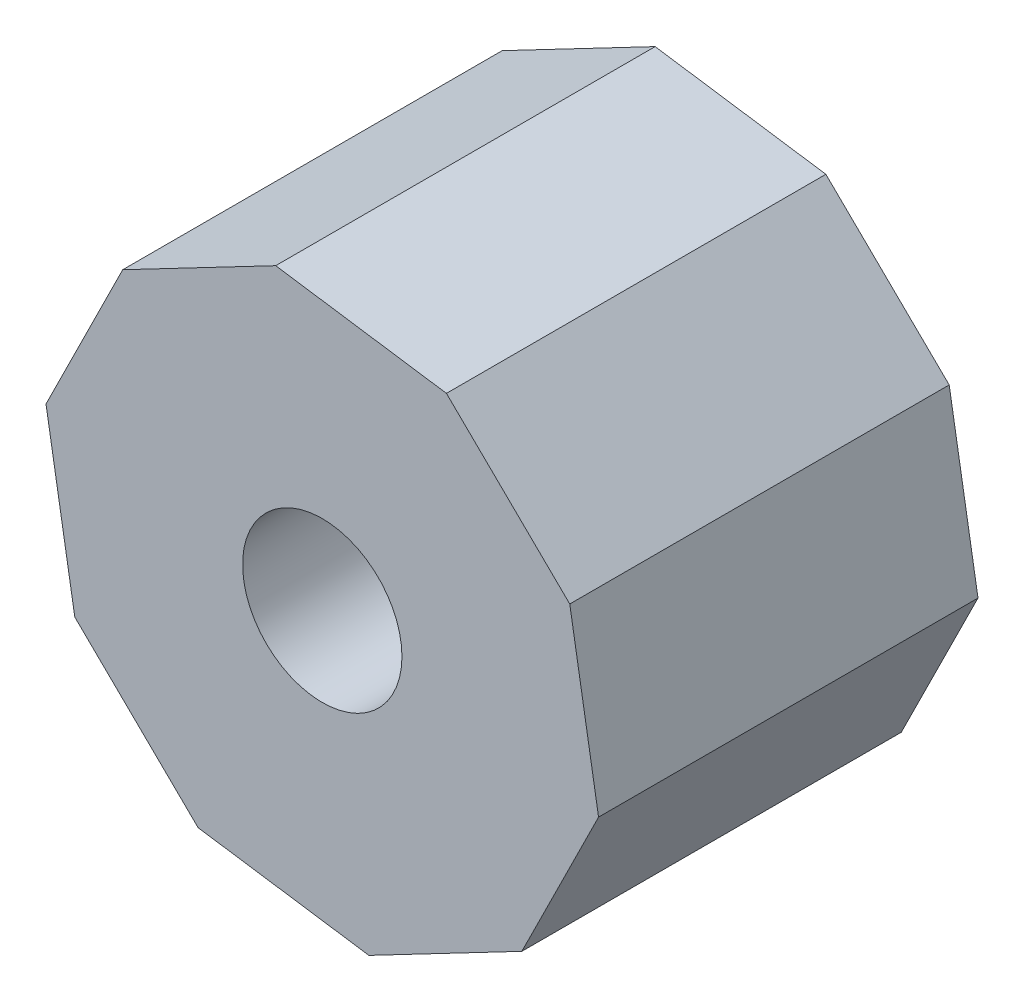
ISO-10303-21;
HEADER;
FILE_DESCRIPTION(('STEP AP214'),'2;1');
FILE_NAME('part.step','',(''),(''),'','','');
FILE_SCHEMA(('AUTOMOTIVE_DESIGN { 1 0 10303 214 1 1 1 1 }'));
ENDSEC;
DATA;
#1=APPLICATION_CONTEXT('core data for automotive mechanical design processes');
#2=APPLICATION_PROTOCOL_DEFINITION('international standard','automotive_design',2000,#1);
#3=PRODUCT_CONTEXT('',#1,'mechanical');
#4=PRODUCT('Part','Part','',(#3));
#5=PRODUCT_RELATED_PRODUCT_CATEGORY('part','',(#4));
#6=PRODUCT_DEFINITION_FORMATION('','',#4);
#7=PRODUCT_DEFINITION_CONTEXT('part definition',#1,'design');
#8=PRODUCT_DEFINITION('design','',#6,#7);
#9=PRODUCT_DEFINITION_SHAPE('','',#8);
#10=(LENGTH_UNIT() NAMED_UNIT(*) SI_UNIT(.MILLI.,.METRE.));
#11=(NAMED_UNIT(*) PLANE_ANGLE_UNIT() SI_UNIT($,.RADIAN.));
#12=(NAMED_UNIT(*) SI_UNIT($,.STERADIAN.) SOLID_ANGLE_UNIT());
#13=UNCERTAINTY_MEASURE_WITH_UNIT(LENGTH_MEASURE(1.E-05),#10,'distance_accuracy_value','');
#14=(GEOMETRIC_REPRESENTATION_CONTEXT(3) GLOBAL_UNCERTAINTY_ASSIGNED_CONTEXT((#13)) GLOBAL_UNIT_ASSIGNED_CONTEXT((#10,
#11,#12)) REPRESENTATION_CONTEXT('',''));
#15=CARTESIAN_POINT('',(0.,0.,0.));
#16=DIRECTION('',(0.,0.,1.));
#17=DIRECTION('',(1.,0.,0.));
#18=AXIS2_PLACEMENT_3D('',#15,#16,#17);
#19=CARTESIAN_POINT('',(-2.54590904960447,-3.21273721995364,10.));
#20=DIRECTION('',(0.14599317271029,0.989285597551073,0.));
#21=DIRECTION('',(-0.989285597551073,0.14599317271029,0.));
#22=AXIS2_PLACEMENT_3D('',#19,#20,#21);
#23=PLANE('',#22);
#24=DIRECTION('',(0.,0.,-1.));
#25=VECTOR('',#24,1.);
#26=CARTESIAN_POINT('',(-2.54590904960447,-3.21273721995364,10.));
#27=LINE('',#26,#25);
#28=CARTESIAN_POINT('',(-2.54590904960447,-3.21273721995364,6.));
#29=VERTEX_POINT('',#28);
#30=CARTESIAN_POINT('',(-2.54590904960447,-3.21273721995364,0.));
#31=VERTEX_POINT('',#30);
#32=EDGE_CURVE('E58',#29,#31,#27,.T.);
#33=ORIENTED_EDGE('',*,*,#32,.F.);
#34=DIRECTION('',(0.989285597551073,-0.14599317271029,0.));
#35=VECTOR('',#34,1.);
#36=CARTESIAN_POINT('',(-2.54590904960447,-3.21273721995364,6.));
#37=LINE('',#36,#35);
#38=CARTESIAN_POINT('',(1.50935752336141,-3.81119052265898,6.));
#39=VERTEX_POINT('',#38);
#40=EDGE_CURVE('E52',#29,#39,#37,.T.);
#41=ORIENTED_EDGE('',*,*,#40,.T.);
#42=DIRECTION('',(0.,0.,-1.));
#43=VECTOR('',#42,1.);
#44=CARTESIAN_POINT('',(1.50935752336141,-3.81119052265898,10.));
#45=LINE('',#44,#43);
#46=CARTESIAN_POINT('',(1.50935752336141,-3.81119052265898,0.));
#47=VERTEX_POINT('',#46);
#48=EDGE_CURVE('E175',#39,#47,#45,.T.);
#49=ORIENTED_EDGE('',*,*,#48,.T.);
#50=DIRECTION('',(0.989285597551073,-0.14599317271029,0.));
#51=VECTOR('',#50,1.);
#52=CARTESIAN_POINT('',(-2.54590904960447,-3.21273721995364,0.));
#53=LINE('',#52,#51);
#54=EDGE_CURVE('E487',#31,#47,#53,.T.);
#55=ORIENTED_EDGE('',*,*,#54,.F.);
#56=EDGE_LOOP('',(#33,#41,#49,#55));
#57=FACE_BOUND('',#56,.T.);
#58=ADVANCED_FACE('F37',(#57),#23,.T.);
#59=CARTESIAN_POINT('',(1.50935752336141,-3.81119052265898,10.));
#60=DIRECTION('',(-0.783749872722152,0.621076595121737,0.));
#61=DIRECTION('',(-0.621076595121737,-0.783749872722153,0.));
#62=AXIS2_PLACEMENT_3D('',#59,#60,#61);
#63=PLANE('',#62);
#64=ORIENTED_EDGE('',*,*,#48,.F.);
#65=DIRECTION('',(0.621076595121737,0.783749872722153,0.));
#66=VECTOR('',#65,1.);
#67=CARTESIAN_POINT('',(1.50935752336141,-3.81119052265898,6.));
#68=LINE('',#67,#66);
#69=CARTESIAN_POINT('',(4.05526657296588,-0.598453302705346,6.));
#70=VERTEX_POINT('',#69);
#71=EDGE_CURVE('E481',#39,#70,#68,.T.);
#72=ORIENTED_EDGE('',*,*,#71,.T.);
#73=DIRECTION('',(0.,0.,-1.));
#74=VECTOR('',#73,1.);
#75=CARTESIAN_POINT('',(4.05526657296588,-0.598453302705346,10.));
#76=LINE('',#75,#74);
#77=CARTESIAN_POINT('',(4.05526657296588,-0.598453302705346,0.));
#78=VERTEX_POINT('',#77);
#79=EDGE_CURVE('E173',#70,#78,#76,.T.);
#80=ORIENTED_EDGE('',*,*,#79,.T.);
#81=DIRECTION('',(0.621076595121737,0.783749872722152,0.));
#82=VECTOR('',#81,1.);
#83=CARTESIAN_POINT('',(1.50935752336141,-3.81119052265898,0.));
#84=LINE('',#83,#82);
#85=EDGE_CURVE('E490',#47,#78,#84,.T.);
#86=ORIENTED_EDGE('',*,*,#85,.F.);
#87=EDGE_LOOP('',(#64,#72,#80,#86));
#88=FACE_BOUND('',#87,.T.);
#89=ADVANCED_FACE('F308',(#88),#63,.T.);
#90=CARTESIAN_POINT('',(4.05526657296588,-0.598453302705346,10.));
#91=DIRECTION('',(-0.929743045432443,-0.368209002429336,0.));
#92=DIRECTION('',(0.368209002429336,-0.929743045432443,0.));
#93=AXIS2_PLACEMENT_3D('',#90,#91,#92);
#94=PLANE('',#93);
#95=ORIENTED_EDGE('',*,*,#79,.F.);
#96=DIRECTION('',(-0.368209002429336,0.929743045432443,0.));
#97=VECTOR('',#96,1.);
#98=CARTESIAN_POINT('',(4.05526657296588,-0.598453302705346,6.));
#99=LINE('',#98,#97);
#100=CARTESIAN_POINT('',(2.54590904960447,3.21273721995364,6.));
#101=VERTEX_POINT('',#100);
#102=EDGE_CURVE('E479',#70,#101,#99,.T.);
#103=ORIENTED_EDGE('',*,*,#102,.T.);
#104=DIRECTION('',(0.,0.,-1.));
#105=VECTOR('',#104,1.);
#106=CARTESIAN_POINT('',(2.54590904960447,3.21273721995364,10.));
#107=LINE('',#106,#105);
#108=CARTESIAN_POINT('',(2.54590904960447,3.21273721995364,0.));
#109=VERTEX_POINT('',#108);
#110=EDGE_CURVE('E167',#101,#109,#107,.T.);
#111=ORIENTED_EDGE('',*,*,#110,.T.);
#112=DIRECTION('',(-0.368209002429336,0.929743045432443,0.));
#113=VECTOR('',#112,1.);
#114=CARTESIAN_POINT('',(4.05526657296588,-0.598453302705346,0.));
#115=LINE('',#114,#113);
#116=EDGE_CURVE('E477',#78,#109,#115,.T.);
#117=ORIENTED_EDGE('',*,*,#116,.F.);
#118=EDGE_LOOP('',(#95,#103,#111,#117));
#119=FACE_BOUND('',#118,.T.);
#120=ADVANCED_FACE('F314',(#119),#94,.T.);
#121=CARTESIAN_POINT('',(2.54590904960447,3.21273721995364,10.));
#122=DIRECTION('',(-0.14599317271029,-0.989285597551073,0.));
#123=DIRECTION('',(0.989285597551073,-0.14599317271029,0.));
#124=AXIS2_PLACEMENT_3D('',#121,#122,#123);
#125=PLANE('',#124);
#126=ORIENTED_EDGE('',*,*,#110,.F.);
#127=DIRECTION('',(-0.989285597551073,0.14599317271029,0.));
#128=VECTOR('',#127,1.);
#129=CARTESIAN_POINT('',(2.54590904960447,3.21273721995364,6.));
#130=LINE('',#129,#128);
#131=CARTESIAN_POINT('',(-1.50935752336141,3.81119052265899,6.));
#132=VERTEX_POINT('',#131);
#133=EDGE_CURVE('E159',#101,#132,#130,.T.);
#134=ORIENTED_EDGE('',*,*,#133,.T.);
#135=DIRECTION('',(0.,0.,-1.));
#136=VECTOR('',#135,1.);
#137=CARTESIAN_POINT('',(-1.50935752336141,3.81119052265899,10.));
#138=LINE('',#137,#136);
#139=CARTESIAN_POINT('',(-1.50935752336141,3.81119052265899,0.));
#140=VERTEX_POINT('',#139);
#141=EDGE_CURVE('E158',#132,#140,#138,.T.);
#142=ORIENTED_EDGE('',*,*,#141,.T.);
#143=DIRECTION('',(-0.989285597551073,0.14599317271029,0.));
#144=VECTOR('',#143,1.);
#145=CARTESIAN_POINT('',(2.54590904960447,3.21273721995364,0.));
#146=LINE('',#145,#144);
#147=EDGE_CURVE('E472',#109,#140,#146,.T.);
#148=ORIENTED_EDGE('',*,*,#147,.F.);
#149=EDGE_LOOP('',(#126,#134,#142,#148));
#150=FACE_BOUND('',#149,.T.);
#151=ADVANCED_FACE('F391',(#150),#125,.T.);
#152=CARTESIAN_POINT('',(-1.50935752336141,3.81119052265899,10.));
#153=DIRECTION('',(0.783749872722153,-0.621076595121737,0.));
#154=DIRECTION('',(0.621076595121737,0.783749872722153,0.));
#155=AXIS2_PLACEMENT_3D('',#152,#153,#154);
#156=PLANE('',#155);
#157=ORIENTED_EDGE('',*,*,#141,.F.);
#158=DIRECTION('',(-0.621076595121737,-0.783749872722153,0.));
#159=VECTOR('',#158,1.);
#160=CARTESIAN_POINT('',(-1.50935752336141,3.81119052265899,6.));
#161=LINE('',#160,#159);
#162=CARTESIAN_POINT('',(-4.05526657296588,0.598453302705348,6.));
#163=VERTEX_POINT('',#162);
#164=EDGE_CURVE('E150',#132,#163,#161,.T.);
#165=ORIENTED_EDGE('',*,*,#164,.T.);
#166=DIRECTION('',(0.,0.,-1.));
#167=VECTOR('',#166,1.);
#168=CARTESIAN_POINT('',(-4.05526657296588,0.598453302705348,10.));
#169=LINE('',#168,#167);
#170=CARTESIAN_POINT('',(-4.05526657296588,0.598453302705348,0.));
#171=VERTEX_POINT('',#170);
#172=EDGE_CURVE('E157',#163,#171,#169,.T.);
#173=ORIENTED_EDGE('',*,*,#172,.T.);
#174=DIRECTION('',(-0.621076595121737,-0.783749872722153,0.));
#175=VECTOR('',#174,1.);
#176=CARTESIAN_POINT('',(-1.50935752336141,3.81119052265899,0.));
#177=LINE('',#176,#175);
#178=EDGE_CURVE('E494',#140,#171,#177,.T.);
#179=ORIENTED_EDGE('',*,*,#178,.F.);
#180=EDGE_LOOP('',(#157,#165,#173,#179));
#181=FACE_BOUND('',#180,.T.);
#182=ADVANCED_FACE('F155',(#181),#156,.T.);
#183=CARTESIAN_POINT('',(-4.05526657296588,0.598453302705348,10.));
#184=DIRECTION('',(0.929743045432443,0.368209002429336,0.));
#185=DIRECTION('',(-0.368209002429336,0.929743045432443,0.));
#186=AXIS2_PLACEMENT_3D('',#183,#184,#185);
#187=PLANE('',#186);
#188=ORIENTED_EDGE('',*,*,#172,.F.);
#189=DIRECTION('',(0.368209002429336,-0.929743045432443,0.));
#190=VECTOR('',#189,1.);
#191=CARTESIAN_POINT('',(-4.05526657296588,0.598453302705348,6.));
#192=LINE('',#191,#190);
#193=EDGE_CURVE('E11',#163,#29,#192,.T.);
#194=ORIENTED_EDGE('',*,*,#193,.T.);
#195=ORIENTED_EDGE('',*,*,#32,.T.);
#196=DIRECTION('',(0.368209002429336,-0.929743045432443,0.));
#197=VECTOR('',#196,1.);
#198=CARTESIAN_POINT('',(-4.05526657296588,0.598453302705348,0.));
#199=LINE('',#198,#197);
#200=EDGE_CURVE('E164',#171,#31,#199,.T.);
#201=ORIENTED_EDGE('',*,*,#200,.F.);
#202=EDGE_LOOP('',(#188,#194,#195,#201));
#203=FACE_BOUND('',#202,.T.);
#204=ADVANCED_FACE('F162',(#203),#187,.T.);
#205=CARTESIAN_POINT('',(0.,0.,10.));
#206=DIRECTION('',(0.,0.,1.));
#207=DIRECTION('',(1.,0.,0.));
#208=AXIS2_PLACEMENT_3D('',#205,#206,#207);
#209=PLANE('',#208);
#210=DIRECTION('',(0.166858303692931,-0.985980885458089,0.));
#211=VECTOR('',#210,1.);
#212=CARTESIAN_POINT('',(-7.28137504365553,1.07454414271095,10.));
#213=LINE('',#212,#211);
#214=CARTESIAN_POINT('',(-7.28137504365553,1.07454414271095,10.));
#215=VERTEX_POINT('',#214);
#216=CARTESIAN_POINT('',(-6.52235735275769,-3.41056039441198,10.));
#217=VERTEX_POINT('',#216);
#218=EDGE_CURVE('E178',#215,#217,#213,.T.);
#219=ORIENTED_EDGE('',*,*,#218,.T.);
#220=DIRECTION('',(0.714536226854697,-0.699598442331209,0.));
#221=VECTOR('',#220,1.);
#222=CARTESIAN_POINT('',(-6.52235735275769,-3.41056039441198,10.));
#223=LINE('',#222,#221);
#224=CARTESIAN_POINT('',(-3.2720208398792,-6.59294678155377,10.));
#225=VERTEX_POINT('',#224);
#226=EDGE_CURVE('E181',#217,#225,#223,.T.);
#227=ORIENTED_EDGE('',*,*,#226,.T.);
#228=DIRECTION('',(0.989285597551073,-0.14599317271029,0.));
#229=VECTOR('',#228,1.);
#230=CARTESIAN_POINT('',(-3.2720208398792,-6.59294678155377,10.));
#231=LINE('',#230,#229);
#232=CARTESIAN_POINT('',(1.22811642193517,-7.25705158416125,10.));
#233=VERTEX_POINT('',#232);
#234=EDGE_CURVE('E184',#225,#233,#231,.T.);
#235=ORIENTED_EDGE('',*,*,#234,.T.);
#236=DIRECTION('',(0.886161494563689,0.463376526760526,0.));
#237=VECTOR('',#236,1.);
#238=CARTESIAN_POINT('',(1.22811642193517,-7.25705158416125,10.));
#239=LINE('',#238,#237);
#240=CARTESIAN_POINT('',(5.25915495271223,-5.14920933973039,10.));
#241=VERTEX_POINT('',#240);
#242=EDGE_CURVE('E186',#233,#241,#239,.T.);
#243=ORIENTED_EDGE('',*,*,#242,.T.);
#244=DIRECTION('',(0.444553820174381,0.895752142597697,0.));
#245=VECTOR('',#244,1.);
#246=CARTESIAN_POINT('',(5.25915495271223,-5.14920933973039,10.));
#247=LINE('',#246,#245);
#248=CARTESIAN_POINT('',(7.28137504365556,-1.07454414271093,10.));
#249=VERTEX_POINT('',#248);
#250=EDGE_CURVE('E188',#241,#249,#247,.T.);
#251=ORIENTED_EDGE('',*,*,#250,.T.);
#252=DIRECTION('',(-0.166858303692931,0.985980885458089,0.));
#253=VECTOR('',#252,1.);
#254=CARTESIAN_POINT('',(7.28137504365556,-1.07454414271093,10.));
#255=LINE('',#254,#253);
#256=CARTESIAN_POINT('',(6.52235735275772,3.41056039441199,10.));
#257=VERTEX_POINT('',#256);
#258=EDGE_CURVE('E190',#249,#257,#255,.T.);
#259=ORIENTED_EDGE('',*,*,#258,.T.);
#260=DIRECTION('',(-0.714536226854697,0.699598442331208,0.));
#261=VECTOR('',#260,1.);
#262=CARTESIAN_POINT('',(6.52235735275772,3.41056039441199,10.));
#263=LINE('',#262,#261);
#264=CARTESIAN_POINT('',(3.27202083987923,6.59294678155378,10.));
#265=VERTEX_POINT('',#264);
#266=EDGE_CURVE('E192',#257,#265,#263,.T.);
#267=ORIENTED_EDGE('',*,*,#266,.T.);
#268=DIRECTION('',(-0.989285597551073,0.14599317271029,0.));
#269=VECTOR('',#268,1.);
#270=CARTESIAN_POINT('',(3.27202083987923,6.59294678155378,10.));
#271=LINE('',#270,#269);
#272=CARTESIAN_POINT('',(-1.22811642193514,7.25705158416126,10.));
#273=VERTEX_POINT('',#272);
#274=EDGE_CURVE('E194',#265,#273,#271,.T.);
#275=ORIENTED_EDGE('',*,*,#274,.T.);
#276=DIRECTION('',(-0.886161494563689,-0.463376526760526,0.));
#277=VECTOR('',#276,1.);
#278=CARTESIAN_POINT('',(-1.22811642193514,7.25705158416126,10.));
#279=LINE('',#278,#277);
#280=CARTESIAN_POINT('',(-5.25915495271219,5.14920933973041,10.));
#281=VERTEX_POINT('',#280);
#282=EDGE_CURVE('E196',#273,#281,#279,.T.);
#283=ORIENTED_EDGE('',*,*,#282,.T.);
#284=DIRECTION('',(-0.444553820174381,-0.895752142597697,0.));
#285=VECTOR('',#284,1.);
#286=CARTESIAN_POINT('',(-5.25915495271219,5.14920933973041,10.));
#287=LINE('',#286,#285);
#288=EDGE_CURVE('E198',#281,#215,#287,.T.);
#289=ORIENTED_EDGE('',*,*,#288,.T.);
#290=EDGE_LOOP('',(#219,#227,#235,#243,#251,#259,#267,#275,#283,#289));
#291=FACE_BOUND('',#290,.T.);
#292=CARTESIAN_POINT('',(0.,0.,10.));
#293=DIRECTION('',(0.,0.,1.));
#294=DIRECTION('',(1.,0.,0.));
#295=AXIS2_PLACEMENT_3D('',#292,#293,#294);
#296=CIRCLE('',#295,2.1);
#297=CARTESIAN_POINT('',(2.1,0.,10.));
#298=VERTEX_POINT('',#297);
#299=EDGE_CURVE('E498',#298,#298,#296,.T.);
#300=ORIENTED_EDGE('',*,*,#299,.F.);
#301=EDGE_LOOP('',(#300));
#302=FACE_BOUND('',#301,.T.);
#303=ADVANCED_FACE('F272',(#291,#302),#209,.T.);
#304=CARTESIAN_POINT('',(0.,0.,0.));
#305=DIRECTION('',(0.,0.,1.));
#306=DIRECTION('',(1.,0.,0.));
#307=AXIS2_PLACEMENT_3D('',#304,#305,#306);
#308=PLANE('',#307);
#309=DIRECTION('',(0.166858303692931,-0.985980885458089,0.));
#310=VECTOR('',#309,1.);
#311=CARTESIAN_POINT('',(-7.28137504365553,1.07454414271095,0.));
#312=LINE('',#311,#310);
#313=CARTESIAN_POINT('',(-7.28137504365553,1.07454414271095,0.));
#314=VERTEX_POINT('',#313);
#315=CARTESIAN_POINT('',(-6.52235735275769,-3.41056039441198,0.));
#316=VERTEX_POINT('',#315);
#317=EDGE_CURVE('E177',#314,#316,#312,.T.);
#318=ORIENTED_EDGE('',*,*,#317,.F.);
#319=DIRECTION('',(-0.444553820174381,-0.895752142597697,0.));
#320=VECTOR('',#319,1.);
#321=CARTESIAN_POINT('',(-5.25915495271219,5.14920933973041,0.));
#322=LINE('',#321,#320);
#323=CARTESIAN_POINT('',(-5.25915495271219,5.14920933973041,0.));
#324=VERTEX_POINT('',#323);
#325=EDGE_CURVE('E182',#324,#314,#322,.T.);
#326=ORIENTED_EDGE('',*,*,#325,.F.);
#327=DIRECTION('',(-0.886161494563689,-0.463376526760526,0.));
#328=VECTOR('',#327,1.);
#329=CARTESIAN_POINT('',(-1.22811642193514,7.25705158416126,0.));
#330=LINE('',#329,#328);
#331=CARTESIAN_POINT('',(-1.22811642193514,7.25705158416126,0.));
#332=VERTEX_POINT('',#331);
#333=EDGE_CURVE('E217',#332,#324,#330,.T.);
#334=ORIENTED_EDGE('',*,*,#333,.F.);
#335=DIRECTION('',(-0.989285597551073,0.14599317271029,0.));
#336=VECTOR('',#335,1.);
#337=CARTESIAN_POINT('',(3.27202083987923,6.59294678155378,0.));
#338=LINE('',#337,#336);
#339=CARTESIAN_POINT('',(3.27202083987923,6.59294678155378,0.));
#340=VERTEX_POINT('',#339);
#341=EDGE_CURVE('E215',#340,#332,#338,.T.);
#342=ORIENTED_EDGE('',*,*,#341,.F.);
#343=DIRECTION('',(-0.714536226854697,0.699598442331208,0.));
#344=VECTOR('',#343,1.);
#345=CARTESIAN_POINT('',(6.52235735275772,3.41056039441199,0.));
#346=LINE('',#345,#344);
#347=CARTESIAN_POINT('',(6.52235735275772,3.41056039441199,0.));
#348=VERTEX_POINT('',#347);
#349=EDGE_CURVE('E213',#348,#340,#346,.T.);
#350=ORIENTED_EDGE('',*,*,#349,.F.);
#351=DIRECTION('',(-0.166858303692931,0.985980885458089,0.));
#352=VECTOR('',#351,1.);
#353=CARTESIAN_POINT('',(7.28137504365556,-1.07454414271093,0.));
#354=LINE('',#353,#352);
#355=CARTESIAN_POINT('',(7.28137504365556,-1.07454414271093,0.));
#356=VERTEX_POINT('',#355);
#357=EDGE_CURVE('E211',#356,#348,#354,.T.);
#358=ORIENTED_EDGE('',*,*,#357,.F.);
#359=DIRECTION('',(0.444553820174381,0.895752142597697,0.));
#360=VECTOR('',#359,1.);
#361=CARTESIAN_POINT('',(5.25915495271223,-5.14920933973039,0.));
#362=LINE('',#361,#360);
#363=CARTESIAN_POINT('',(5.25915495271223,-5.14920933973039,0.));
#364=VERTEX_POINT('',#363);
#365=EDGE_CURVE('E209',#364,#356,#362,.T.);
#366=ORIENTED_EDGE('',*,*,#365,.F.);
#367=DIRECTION('',(0.886161494563689,0.463376526760526,0.));
#368=VECTOR('',#367,1.);
#369=CARTESIAN_POINT('',(1.22811642193517,-7.25705158416125,0.));
#370=LINE('',#369,#368);
#371=CARTESIAN_POINT('',(1.22811642193517,-7.25705158416125,0.));
#372=VERTEX_POINT('',#371);
#373=EDGE_CURVE('E207',#372,#364,#370,.T.);
#374=ORIENTED_EDGE('',*,*,#373,.F.);
#375=DIRECTION('',(0.989285597551073,-0.14599317271029,0.));
#376=VECTOR('',#375,1.);
#377=CARTESIAN_POINT('',(-3.2720208398792,-6.59294678155377,0.));
#378=LINE('',#377,#376);
#379=CARTESIAN_POINT('',(-3.2720208398792,-6.59294678155377,0.));
#380=VERTEX_POINT('',#379);
#381=EDGE_CURVE('E205',#380,#372,#378,.T.);
#382=ORIENTED_EDGE('',*,*,#381,.F.);
#383=DIRECTION('',(0.714536226854697,-0.699598442331209,0.));
#384=VECTOR('',#383,1.);
#385=CARTESIAN_POINT('',(-6.52235735275769,-3.41056039441198,0.));
#386=LINE('',#385,#384);
#387=EDGE_CURVE('E203',#316,#380,#386,.T.);
#388=ORIENTED_EDGE('',*,*,#387,.F.);
#389=EDGE_LOOP('',(#318,#326,#334,#342,#350,#358,#366,#374,#382,#388));
#390=FACE_BOUND('',#389,.T.);
#391=ORIENTED_EDGE('',*,*,#54,.T.);
#392=ORIENTED_EDGE('',*,*,#85,.T.);
#393=ORIENTED_EDGE('',*,*,#116,.T.);
#394=ORIENTED_EDGE('',*,*,#147,.T.);
#395=ORIENTED_EDGE('',*,*,#178,.T.);
#396=ORIENTED_EDGE('',*,*,#200,.T.);
#397=EDGE_LOOP('',(#391,#392,#393,#394,#395,#396));
#398=FACE_BOUND('',#397,.T.);
#399=ADVANCED_FACE('F256',(#390,#398),#308,.F.);
#400=CARTESIAN_POINT('',(-7.28137504365553,1.07454414271095,10.));
#401=DIRECTION('',(0.985980885458089,0.166858303692931,0.));
#402=DIRECTION('',(-0.166858303692931,0.985980885458089,0.));
#403=AXIS2_PLACEMENT_3D('',#400,#401,#402);
#404=PLANE('',#403);
#405=ORIENTED_EDGE('',*,*,#317,.T.);
#406=DIRECTION('',(0.,0.,-1.));
#407=VECTOR('',#406,1.);
#408=CARTESIAN_POINT('',(-6.52235735275769,-3.41056039441198,10.));
#409=LINE('',#408,#407);
#410=EDGE_CURVE('E45',#217,#316,#409,.T.);
#411=ORIENTED_EDGE('',*,*,#410,.F.);
#412=ORIENTED_EDGE('',*,*,#218,.F.);
#413=DIRECTION('',(0.,0.,-1.));
#414=VECTOR('',#413,1.);
#415=CARTESIAN_POINT('',(-7.28137504365553,1.07454414271095,10.));
#416=LINE('',#415,#414);
#417=EDGE_CURVE('E200',#215,#314,#416,.T.);
#418=ORIENTED_EDGE('',*,*,#417,.T.);
#419=EDGE_LOOP('',(#405,#411,#412,#418));
#420=FACE_BOUND('',#419,.T.);
#421=ADVANCED_FACE('F39',(#420),#404,.F.);
#422=CARTESIAN_POINT('',(-6.52235735275769,-3.41056039441198,10.));
#423=DIRECTION('',(0.699598442331209,0.714536226854697,0.));
#424=DIRECTION('',(-0.714536226854697,0.699598442331209,0.));
#425=AXIS2_PLACEMENT_3D('',#422,#423,#424);
#426=PLANE('',#425);
#427=ORIENTED_EDGE('',*,*,#387,.T.);
#428=DIRECTION('',(0.,0.,-1.));
#429=VECTOR('',#428,1.);
#430=CARTESIAN_POINT('',(-3.2720208398792,-6.59294678155377,10.));
#431=LINE('',#430,#429);
#432=EDGE_CURVE('E243',#225,#380,#431,.T.);
#433=ORIENTED_EDGE('',*,*,#432,.F.);
#434=ORIENTED_EDGE('',*,*,#226,.F.);
#435=ORIENTED_EDGE('',*,*,#410,.T.);
#436=EDGE_LOOP('',(#427,#433,#434,#435));
#437=FACE_BOUND('',#436,.T.);
#438=ADVANCED_FACE('F248',(#437),#426,.F.);
#439=CARTESIAN_POINT('',(-3.2720208398792,-6.59294678155377,10.));
#440=DIRECTION('',(0.14599317271029,0.989285597551073,0.));
#441=DIRECTION('',(-0.989285597551073,0.14599317271029,0.));
#442=AXIS2_PLACEMENT_3D('',#439,#440,#441);
#443=PLANE('',#442);
#444=ORIENTED_EDGE('',*,*,#381,.T.);
#445=DIRECTION('',(0.,0.,-1.));
#446=VECTOR('',#445,1.);
#447=CARTESIAN_POINT('',(1.22811642193517,-7.25705158416125,10.));
#448=LINE('',#447,#446);
#449=EDGE_CURVE('E240',#233,#372,#448,.T.);
#450=ORIENTED_EDGE('',*,*,#449,.F.);
#451=ORIENTED_EDGE('',*,*,#234,.F.);
#452=ORIENTED_EDGE('',*,*,#432,.T.);
#453=EDGE_LOOP('',(#444,#450,#451,#452));
#454=FACE_BOUND('',#453,.T.);
#455=ADVANCED_FACE('F264',(#454),#443,.F.);
#456=CARTESIAN_POINT('',(1.22811642193517,-7.25705158416125,10.));
#457=DIRECTION('',(-0.463376526760526,0.886161494563689,0.));
#458=DIRECTION('',(-0.886161494563689,-0.463376526760526,0.));
#459=AXIS2_PLACEMENT_3D('',#456,#457,#458);
#460=PLANE('',#459);
#461=ORIENTED_EDGE('',*,*,#373,.T.);
#462=DIRECTION('',(0.,0.,-1.));
#463=VECTOR('',#462,1.);
#464=CARTESIAN_POINT('',(5.25915495271223,-5.14920933973039,10.));
#465=LINE('',#464,#463);
#466=EDGE_CURVE('E237',#241,#364,#465,.T.);
#467=ORIENTED_EDGE('',*,*,#466,.F.);
#468=ORIENTED_EDGE('',*,*,#242,.F.);
#469=ORIENTED_EDGE('',*,*,#449,.T.);
#470=EDGE_LOOP('',(#461,#467,#468,#469));
#471=FACE_BOUND('',#470,.T.);
#472=ADVANCED_FACE('F268',(#471),#460,.F.);
#473=CARTESIAN_POINT('',(5.25915495271223,-5.14920933973039,10.));
#474=DIRECTION('',(-0.895752142597697,0.444553820174381,0.));
#475=DIRECTION('',(-0.444553820174381,-0.895752142597697,0.));
#476=AXIS2_PLACEMENT_3D('',#473,#474,#475);
#477=PLANE('',#476);
#478=ORIENTED_EDGE('',*,*,#365,.T.);
#479=DIRECTION('',(0.,0.,-1.));
#480=VECTOR('',#479,1.);
#481=CARTESIAN_POINT('',(7.28137504365556,-1.07454414271093,10.));
#482=LINE('',#481,#480);
#483=EDGE_CURVE('E234',#249,#356,#482,.T.);
#484=ORIENTED_EDGE('',*,*,#483,.F.);
#485=ORIENTED_EDGE('',*,*,#250,.F.);
#486=ORIENTED_EDGE('',*,*,#466,.T.);
#487=EDGE_LOOP('',(#478,#484,#485,#486));
#488=FACE_BOUND('',#487,.T.);
#489=ADVANCED_FACE('F298',(#488),#477,.F.);
#490=CARTESIAN_POINT('',(7.28137504365556,-1.07454414271093,10.));
#491=DIRECTION('',(-0.985980885458089,-0.166858303692931,0.));
#492=DIRECTION('',(0.166858303692931,-0.985980885458089,0.));
#493=AXIS2_PLACEMENT_3D('',#490,#491,#492);
#494=PLANE('',#493);
#495=ORIENTED_EDGE('',*,*,#357,.T.);
#496=DIRECTION('',(0.,0.,-1.));
#497=VECTOR('',#496,1.);
#498=CARTESIAN_POINT('',(6.52235735275772,3.41056039441199,10.));
#499=LINE('',#498,#497);
#500=EDGE_CURVE('E231',#257,#348,#499,.T.);
#501=ORIENTED_EDGE('',*,*,#500,.F.);
#502=ORIENTED_EDGE('',*,*,#258,.F.);
#503=ORIENTED_EDGE('',*,*,#483,.T.);
#504=EDGE_LOOP('',(#495,#501,#502,#503));
#505=FACE_BOUND('',#504,.T.);
#506=ADVANCED_FACE('F296',(#505),#494,.F.);
#507=CARTESIAN_POINT('',(6.52235735275772,3.41056039441199,10.));
#508=DIRECTION('',(-0.699598442331208,-0.714536226854697,0.));
#509=DIRECTION('',(0.714536226854697,-0.699598442331209,0.));
#510=AXIS2_PLACEMENT_3D('',#507,#508,#509);
#511=PLANE('',#510);
#512=ORIENTED_EDGE('',*,*,#349,.T.);
#513=DIRECTION('',(0.,0.,-1.));
#514=VECTOR('',#513,1.);
#515=CARTESIAN_POINT('',(3.27202083987923,6.59294678155378,10.));
#516=LINE('',#515,#514);
#517=EDGE_CURVE('E228',#265,#340,#516,.T.);
#518=ORIENTED_EDGE('',*,*,#517,.F.);
#519=ORIENTED_EDGE('',*,*,#266,.F.);
#520=ORIENTED_EDGE('',*,*,#500,.T.);
#521=EDGE_LOOP('',(#512,#518,#519,#520));
#522=FACE_BOUND('',#521,.T.);
#523=ADVANCED_FACE('F292',(#522),#511,.F.);
#524=CARTESIAN_POINT('',(3.27202083987923,6.59294678155378,10.));
#525=DIRECTION('',(-0.14599317271029,-0.989285597551073,0.));
#526=DIRECTION('',(0.989285597551073,-0.14599317271029,0.));
#527=AXIS2_PLACEMENT_3D('',#524,#525,#526);
#528=PLANE('',#527);
#529=ORIENTED_EDGE('',*,*,#341,.T.);
#530=DIRECTION('',(0.,0.,-1.));
#531=VECTOR('',#530,1.);
#532=CARTESIAN_POINT('',(-1.22811642193514,7.25705158416126,10.));
#533=LINE('',#532,#531);
#534=EDGE_CURVE('E225',#273,#332,#533,.T.);
#535=ORIENTED_EDGE('',*,*,#534,.F.);
#536=ORIENTED_EDGE('',*,*,#274,.F.);
#537=ORIENTED_EDGE('',*,*,#517,.T.);
#538=EDGE_LOOP('',(#529,#535,#536,#537));
#539=FACE_BOUND('',#538,.T.);
#540=ADVANCED_FACE('F287',(#539),#528,.F.);
#541=CARTESIAN_POINT('',(-1.22811642193514,7.25705158416126,10.));
#542=DIRECTION('',(0.463376526760526,-0.886161494563689,0.));
#543=DIRECTION('',(0.886161494563689,0.463376526760526,0.));
#544=AXIS2_PLACEMENT_3D('',#541,#542,#543);
#545=PLANE('',#544);
#546=ORIENTED_EDGE('',*,*,#333,.T.);
#547=DIRECTION('',(0.,0.,-1.));
#548=VECTOR('',#547,1.);
#549=CARTESIAN_POINT('',(-5.25915495271219,5.14920933973041,10.));
#550=LINE('',#549,#548);
#551=EDGE_CURVE('E222',#281,#324,#550,.T.);
#552=ORIENTED_EDGE('',*,*,#551,.F.);
#553=ORIENTED_EDGE('',*,*,#282,.F.);
#554=ORIENTED_EDGE('',*,*,#534,.T.);
#555=EDGE_LOOP('',(#546,#552,#553,#554));
#556=FACE_BOUND('',#555,.T.);
#557=ADVANCED_FACE('F281',(#556),#545,.F.);
#558=CARTESIAN_POINT('',(-5.25915495271219,5.14920933973041,10.));
#559=DIRECTION('',(0.895752142597696,-0.444553820174381,0.));
#560=DIRECTION('',(0.444553820174381,0.895752142597696,0.));
#561=AXIS2_PLACEMENT_3D('',#558,#559,#560);
#562=PLANE('',#561);
#563=ORIENTED_EDGE('',*,*,#325,.T.);
#564=ORIENTED_EDGE('',*,*,#417,.F.);
#565=ORIENTED_EDGE('',*,*,#288,.F.);
#566=ORIENTED_EDGE('',*,*,#551,.T.);
#567=EDGE_LOOP('',(#563,#564,#565,#566));
#568=FACE_BOUND('',#567,.T.);
#569=ADVANCED_FACE('F279',(#568),#562,.F.);
#570=CARTESIAN_POINT('',(0.,0.,6.));
#571=DIRECTION('',(0.,0.,1.));
#572=DIRECTION('',(1.,0.,0.));
#573=AXIS2_PLACEMENT_3D('',#570,#571,#572);
#574=PLANE('',#573);
#575=ORIENTED_EDGE('',*,*,#40,.F.);
#576=ORIENTED_EDGE('',*,*,#193,.F.);
#577=ORIENTED_EDGE('',*,*,#164,.F.);
#578=ORIENTED_EDGE('',*,*,#133,.F.);
#579=ORIENTED_EDGE('',*,*,#102,.F.);
#580=ORIENTED_EDGE('',*,*,#71,.F.);
#581=EDGE_LOOP('',(#575,#576,#577,#578,#579,#580));
#582=FACE_BOUND('',#581,.T.);
#583=CARTESIAN_POINT('',(0.,0.,6.));
#584=DIRECTION('',(0.,0.,1.));
#585=DIRECTION('',(1.,0.,0.));
#586=AXIS2_PLACEMENT_3D('',#583,#584,#585);
#587=CIRCLE('',#586,2.1);
#588=CARTESIAN_POINT('',(2.1,0.,6.));
#589=VERTEX_POINT('',#588);
#590=EDGE_CURVE('E160',#589,#589,#587,.T.);
#591=ORIENTED_EDGE('',*,*,#590,.T.);
#592=EDGE_LOOP('',(#591));
#593=FACE_BOUND('',#592,.T.);
#594=ADVANCED_FACE('F148',(#582,#593),#574,.F.);
#595=CARTESIAN_POINT('',(0.,0.,6.));
#596=DIRECTION('',(0.,0.,1.));
#597=DIRECTION('',(1.,0.,0.));
#598=AXIS2_PLACEMENT_3D('',#595,#596,#597);
#599=CYLINDRICAL_SURFACE('',#598,2.1);
#600=ORIENTED_EDGE('',*,*,#590,.F.);
#601=EDGE_LOOP('',(#600));
#602=FACE_BOUND('',#601,.T.);
#603=ORIENTED_EDGE('',*,*,#299,.T.);
#604=EDGE_LOOP('',(#603));
#605=FACE_BOUND('',#604,.T.);
#606=ADVANCED_FACE('F352',(#602,#605),#599,.F.);
#607=CLOSED_SHELL('',(#58,#89,#120,#151,#182,#204,#303,#399,#421,#438,#455,#472,#489,#506,#523,
#540,#557,#569,#594,#606));
#608=MANIFOLD_SOLID_BREP('B2',#607);
#609=ADVANCED_BREP_SHAPE_REPRESENTATION('',(#18,#608),#14);
#610=SHAPE_DEFINITION_REPRESENTATION(#9,#609);
ENDSEC;
END-ISO-10303-21;
